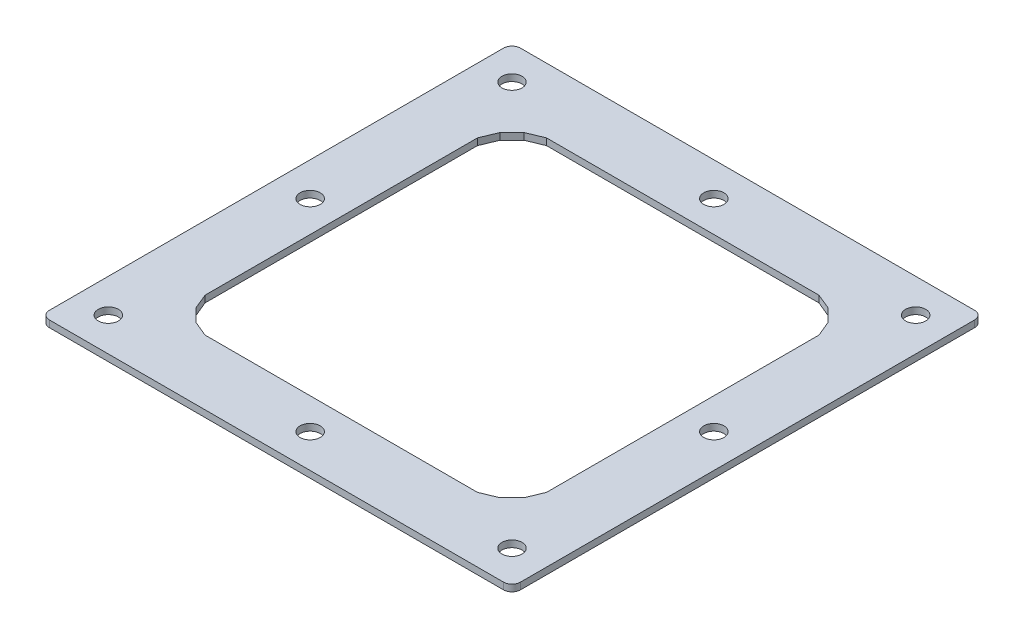
ISO-10303-21;
HEADER;
FILE_DESCRIPTION(('STEP AP214'),'2;1');
FILE_NAME('part.step','',(''),(''),'','','');
FILE_SCHEMA(('AUTOMOTIVE_DESIGN { 1 0 10303 214 1 1 1 1 }'));
ENDSEC;
DATA;
#1=APPLICATION_CONTEXT('core data for automotive mechanical design processes');
#2=APPLICATION_PROTOCOL_DEFINITION('international standard','automotive_design',2000,#1);
#3=PRODUCT_CONTEXT('',#1,'mechanical');
#4=PRODUCT('Part','Part','',(#3));
#5=PRODUCT_RELATED_PRODUCT_CATEGORY('part','',(#4));
#6=PRODUCT_DEFINITION_FORMATION('','',#4);
#7=PRODUCT_DEFINITION_CONTEXT('part definition',#1,'design');
#8=PRODUCT_DEFINITION('design','',#6,#7);
#9=PRODUCT_DEFINITION_SHAPE('','',#8);
#10=(LENGTH_UNIT() NAMED_UNIT(*) SI_UNIT(.MILLI.,.METRE.));
#11=(NAMED_UNIT(*) PLANE_ANGLE_UNIT() SI_UNIT($,.RADIAN.));
#12=(NAMED_UNIT(*) SI_UNIT($,.STERADIAN.) SOLID_ANGLE_UNIT());
#13=UNCERTAINTY_MEASURE_WITH_UNIT(LENGTH_MEASURE(1.E-05),#10,'distance_accuracy_value','');
#14=(GEOMETRIC_REPRESENTATION_CONTEXT(3) GLOBAL_UNCERTAINTY_ASSIGNED_CONTEXT((#13)) GLOBAL_UNIT_ASSIGNED_CONTEXT((#10,
#11,#12)) REPRESENTATION_CONTEXT('',''));
#15=CARTESIAN_POINT('',(0.,0.,0.));
#16=DIRECTION('',(0.,0.,1.));
#17=DIRECTION('',(1.,0.,0.));
#18=AXIS2_PLACEMENT_3D('',#15,#16,#17);
#19=CARTESIAN_POINT('',(140.,1552.70174894829,140.));
#20=DIRECTION('',(-1.,0.,0.));
#21=DIRECTION('',(0.,0.,1.));
#22=AXIS2_PLACEMENT_3D('',#19,#20,#21);
#23=PLANE('',#22);
#24=DIRECTION('',(0.,0.,1.));
#25=VECTOR('',#24,1.);
#26=CARTESIAN_POINT('',(140.,1548.70174894829,0.));
#27=LINE('',#26,#25);
#28=CARTESIAN_POINT('',(140.,1548.70174894829,-135.000000000001));
#29=VERTEX_POINT('',#28);
#30=CARTESIAN_POINT('',(140.,1548.70174894829,135.));
#31=VERTEX_POINT('',#30);
#32=EDGE_CURVE('E356',#29,#31,#27,.T.);
#33=ORIENTED_EDGE('',*,*,#32,.F.);
#34=DIRECTION('',(0.,-1.,0.));
#35=VECTOR('',#34,1.);
#36=CARTESIAN_POINT('',(140.,1552.70174894829,-135.000000000001));
#37=LINE('',#36,#35);
#38=CARTESIAN_POINT('',(140.,1552.70174894829,-135.000000000001));
#39=VERTEX_POINT('',#38);
#40=EDGE_CURVE('E414',#29,#39,#37,.F.);
#41=ORIENTED_EDGE('',*,*,#40,.T.);
#42=DIRECTION('',(0.,0.,1.));
#43=VECTOR('',#42,1.);
#44=CARTESIAN_POINT('',(140.,1552.70174894829,140.));
#45=LINE('',#44,#43);
#46=CARTESIAN_POINT('',(140.,1552.70174894829,135.));
#47=VERTEX_POINT('',#46);
#48=EDGE_CURVE('E274',#39,#47,#45,.T.);
#49=ORIENTED_EDGE('',*,*,#48,.T.);
#50=DIRECTION('',(0.,-1.,0.));
#51=VECTOR('',#50,1.);
#52=CARTESIAN_POINT('',(140.,1552.70174894829,135.));
#53=LINE('',#52,#51);
#54=EDGE_CURVE('E412',#47,#31,#53,.T.);
#55=ORIENTED_EDGE('',*,*,#54,.T.);
#56=EDGE_LOOP('',(#33,#41,#49,#55));
#57=FACE_BOUND('',#56,.T.);
#58=ADVANCED_FACE('F38',(#57),#23,.F.);
#59=CARTESIAN_POINT('',(140.,1552.70174894829,-140.000000000001));
#60=DIRECTION('',(0.,0.,1.));
#61=DIRECTION('',(1.,0.,0.));
#62=AXIS2_PLACEMENT_3D('',#59,#60,#61);
#63=PLANE('',#62);
#64=DIRECTION('',(1.,0.,0.));
#65=VECTOR('',#64,1.);
#66=CARTESIAN_POINT('',(0.,1548.70174894829,-140.000000000001));
#67=LINE('',#66,#65);
#68=CARTESIAN_POINT('',(-135.,1548.70174894829,-140.000000000001));
#69=VERTEX_POINT('',#68);
#70=CARTESIAN_POINT('',(135.,1548.70174894829,-140.000000000001));
#71=VERTEX_POINT('',#70);
#72=EDGE_CURVE('E352',#69,#71,#67,.T.);
#73=ORIENTED_EDGE('',*,*,#72,.F.);
#74=DIRECTION('',(0.,-1.,0.));
#75=VECTOR('',#74,1.);
#76=CARTESIAN_POINT('',(-135.,1552.70174894829,-140.000000000001));
#77=LINE('',#76,#75);
#78=CARTESIAN_POINT('',(-135.,1552.70174894829,-140.000000000001));
#79=VERTEX_POINT('',#78);
#80=EDGE_CURVE('E389',#69,#79,#77,.F.);
#81=ORIENTED_EDGE('',*,*,#80,.T.);
#82=DIRECTION('',(1.,0.,0.));
#83=VECTOR('',#82,1.);
#84=CARTESIAN_POINT('',(140.,1552.70174894829,-140.000000000001));
#85=LINE('',#84,#83);
#86=CARTESIAN_POINT('',(135.,1552.70174894829,-140.000000000001));
#87=VERTEX_POINT('',#86);
#88=EDGE_CURVE('E212',#79,#87,#85,.T.);
#89=ORIENTED_EDGE('',*,*,#88,.T.);
#90=DIRECTION('',(0.,-1.,0.));
#91=VECTOR('',#90,1.);
#92=CARTESIAN_POINT('',(135.,1552.70174894829,-140.000000000001));
#93=LINE('',#92,#91);
#94=EDGE_CURVE('E386',#87,#71,#93,.T.);
#95=ORIENTED_EDGE('',*,*,#94,.T.);
#96=EDGE_LOOP('',(#73,#81,#89,#95));
#97=FACE_BOUND('',#96,.T.);
#98=ADVANCED_FACE('F444',(#97),#63,.F.);
#99=CARTESIAN_POINT('',(-140.,1552.70174894829,139.999999999999));
#100=DIRECTION('',(1.,0.,0.));
#101=DIRECTION('',(0.,0.,-1.));
#102=AXIS2_PLACEMENT_3D('',#99,#100,#101);
#103=PLANE('',#102);
#104=DIRECTION('',(0.,0.,-1.));
#105=VECTOR('',#104,1.);
#106=CARTESIAN_POINT('',(-140.,1552.70174894829,139.999999999999));
#107=LINE('',#106,#105);
#108=CARTESIAN_POINT('',(-140.,1552.70174894829,134.999999999999));
#109=VERTEX_POINT('',#108);
#110=CARTESIAN_POINT('',(-140.,1552.70174894829,-135.000000000001));
#111=VERTEX_POINT('',#110);
#112=EDGE_CURVE('E269',#109,#111,#107,.T.);
#113=ORIENTED_EDGE('',*,*,#112,.T.);
#114=DIRECTION('',(0.,-1.,0.));
#115=VECTOR('',#114,1.);
#116=CARTESIAN_POINT('',(-140.,1552.70174894829,-135.000000000001));
#117=LINE('',#116,#115);
#118=CARTESIAN_POINT('',(-140.,1548.70174894829,-135.000000000001));
#119=VERTEX_POINT('',#118);
#120=EDGE_CURVE('E403',#111,#119,#117,.T.);
#121=ORIENTED_EDGE('',*,*,#120,.T.);
#122=DIRECTION('',(0.,0.,1.));
#123=VECTOR('',#122,1.);
#124=CARTESIAN_POINT('',(-140.,1548.70174894829,0.));
#125=LINE('',#124,#123);
#126=CARTESIAN_POINT('',(-140.,1548.70174894829,134.999999999999));
#127=VERTEX_POINT('',#126);
#128=EDGE_CURVE('E308',#127,#119,#125,.F.);
#129=ORIENTED_EDGE('',*,*,#128,.F.);
#130=DIRECTION('',(0.,-1.,0.));
#131=VECTOR('',#130,1.);
#132=CARTESIAN_POINT('',(-140.,1552.70174894829,134.999999999999));
#133=LINE('',#132,#131);
#134=EDGE_CURVE('E400',#127,#109,#133,.F.);
#135=ORIENTED_EDGE('',*,*,#134,.T.);
#136=EDGE_LOOP('',(#113,#121,#129,#135));
#137=FACE_BOUND('',#136,.T.);
#138=ADVANCED_FACE('F436',(#137),#103,.F.);
#139=CARTESIAN_POINT('',(-101.520883881533,1552.70174894829,-80.9836426045951));
#140=DIRECTION('',(0.923879532511287,0.,0.38268343236509));
#141=DIRECTION('',(0.38268343236509,0.,-0.923879532511287));
#142=AXIS2_PLACEMENT_3D('',#139,#140,#141);
#143=PLANE('',#142);
#144=DIRECTION('',(0.,1.,0.));
#145=VECTOR('',#144,1.);
#146=CARTESIAN_POINT('',(-101.520883881533,1552.70174894829,-80.9836426045951));
#147=LINE('',#146,#145);
#148=CARTESIAN_POINT('',(-101.520883881533,1548.70174894829,-80.9836426045951));
#149=VERTEX_POINT('',#148);
#150=CARTESIAN_POINT('',(-101.520883881533,1552.70174894829,-80.9836426045951));
#151=VERTEX_POINT('',#150);
#152=EDGE_CURVE('E227',#149,#151,#147,.T.);
#153=ORIENTED_EDGE('',*,*,#152,.F.);
#154=DIRECTION('',(0.38268343236509,0.,-0.923879532511287));
#155=VECTOR('',#154,1.);
#156=CARTESIAN_POINT('',(-101.520883881533,1548.70174894829,-80.9836426045951));
#157=LINE('',#156,#155);
#158=CARTESIAN_POINT('',(-97.6179290903931,1548.70174894829,-90.4062089946933));
#159=VERTEX_POINT('',#158);
#160=EDGE_CURVE('E345',#149,#159,#157,.T.);
#161=ORIENTED_EDGE('',*,*,#160,.T.);
#162=DIRECTION('',(0.,1.,0.));
#163=VECTOR('',#162,1.);
#164=CARTESIAN_POINT('',(-97.6179290903931,1552.70174894829,-90.4062089946933));
#165=LINE('',#164,#163);
#166=CARTESIAN_POINT('',(-97.6179290903931,1552.70174894829,-90.4062089946933));
#167=VERTEX_POINT('',#166);
#168=EDGE_CURVE('E384',#159,#167,#165,.T.);
#169=ORIENTED_EDGE('',*,*,#168,.T.);
#170=DIRECTION('',(0.38268343236509,0.,-0.923879532511287));
#171=VECTOR('',#170,1.);
#172=CARTESIAN_POINT('',(-101.520883881533,1552.70174894829,-80.9836426045951));
#173=LINE('',#172,#171);
#174=EDGE_CURVE('E228',#151,#167,#173,.T.);
#175=ORIENTED_EDGE('',*,*,#174,.F.);
#176=EDGE_LOOP('',(#153,#161,#169,#175));
#177=FACE_BOUND('',#176,.T.);
#178=ADVANCED_FACE('F479',(#177),#143,.T.);
#179=CARTESIAN_POINT('',(-97.6179290903931,1552.70174894829,-90.4062089946933));
#180=DIRECTION('',(0.707106781186549,0.,0.707106781186546));
#181=DIRECTION('',(0.707106781186546,0.,-0.707106781186549));
#182=AXIS2_PLACEMENT_3D('',#179,#180,#181);
#183=PLANE('',#182);
#184=ORIENTED_EDGE('',*,*,#168,.F.);
#185=DIRECTION('',(0.707106781186546,0.,-0.707106781186549));
#186=VECTOR('',#185,1.);
#187=CARTESIAN_POINT('',(-97.6179290903931,1548.70174894829,-90.4062089946933));
#188=LINE('',#187,#186);
#189=CARTESIAN_POINT('',(-90.4062089946916,1548.70174894829,-97.6179290903948));
#190=VERTEX_POINT('',#189);
#191=EDGE_CURVE('E342',#159,#190,#188,.T.);
#192=ORIENTED_EDGE('',*,*,#191,.T.);
#193=DIRECTION('',(0.,1.,0.));
#194=VECTOR('',#193,1.);
#195=CARTESIAN_POINT('',(-90.4062089946916,1552.70174894829,-97.6179290903948));
#196=LINE('',#195,#194);
#197=CARTESIAN_POINT('',(-90.4062089946916,1552.70174894829,-97.6179290903948));
#198=VERTEX_POINT('',#197);
#199=EDGE_CURVE('E382',#190,#198,#196,.T.);
#200=ORIENTED_EDGE('',*,*,#199,.T.);
#201=DIRECTION('',(0.707106781186546,0.,-0.707106781186549));
#202=VECTOR('',#201,1.);
#203=CARTESIAN_POINT('',(-97.6179290903931,1552.70174894829,-90.4062089946933));
#204=LINE('',#203,#202);
#205=EDGE_CURVE('E230',#167,#198,#204,.T.);
#206=ORIENTED_EDGE('',*,*,#205,.F.);
#207=EDGE_LOOP('',(#184,#192,#200,#206));
#208=FACE_BOUND('',#207,.T.);
#209=ADVANCED_FACE('F485',(#208),#183,.T.);
#210=CARTESIAN_POINT('',(-90.4062089946916,1552.70174894829,-97.6179290903948));
#211=DIRECTION('',(0.382683432365089,0.,0.923879532511287));
#212=DIRECTION('',(0.923879532511287,0.,-0.382683432365089));
#213=AXIS2_PLACEMENT_3D('',#210,#211,#212);
#214=PLANE('',#213);
#215=ORIENTED_EDGE('',*,*,#199,.F.);
#216=DIRECTION('',(0.923879532511287,0.,-0.382683432365089));
#217=VECTOR('',#216,1.);
#218=CARTESIAN_POINT('',(-90.4062089946916,1548.70174894829,-97.6179290903948));
#219=LINE('',#218,#217);
#220=CARTESIAN_POINT('',(-80.9836426045933,1548.70174894829,-101.520883881534));
#221=VERTEX_POINT('',#220);
#222=EDGE_CURVE('E339',#190,#221,#219,.T.);
#223=ORIENTED_EDGE('',*,*,#222,.T.);
#224=DIRECTION('',(0.,1.,0.));
#225=VECTOR('',#224,1.);
#226=CARTESIAN_POINT('',(-80.9836426045933,1552.70174894829,-101.520883881534));
#227=LINE('',#226,#225);
#228=CARTESIAN_POINT('',(-80.9836426045933,1552.70174894829,-101.520883881534));
#229=VERTEX_POINT('',#228);
#230=EDGE_CURVE('E380',#221,#229,#227,.T.);
#231=ORIENTED_EDGE('',*,*,#230,.T.);
#232=DIRECTION('',(0.923879532511287,0.,-0.382683432365089));
#233=VECTOR('',#232,1.);
#234=CARTESIAN_POINT('',(-90.4062089946916,1552.70174894829,-97.6179290903948));
#235=LINE('',#234,#233);
#236=EDGE_CURVE('E236',#198,#229,#235,.T.);
#237=ORIENTED_EDGE('',*,*,#236,.F.);
#238=EDGE_LOOP('',(#215,#223,#231,#237));
#239=FACE_BOUND('',#238,.T.);
#240=ADVANCED_FACE('F490',(#239),#214,.T.);
#241=CARTESIAN_POINT('',(-80.9836426045933,1552.70174894829,-101.520883881534));
#242=DIRECTION('',(0.,0.,1.));
#243=DIRECTION('',(1.,0.,0.));
#244=AXIS2_PLACEMENT_3D('',#241,#242,#243);
#245=PLANE('',#244);
#246=ORIENTED_EDGE('',*,*,#230,.F.);
#247=DIRECTION('',(1.,0.,0.));
#248=VECTOR('',#247,1.);
#249=CARTESIAN_POINT('',(0.,1548.70174894829,-101.520883881534));
#250=LINE('',#249,#248);
#251=CARTESIAN_POINT('',(80.9836426045933,1548.70174894829,-101.520883881534));
#252=VERTEX_POINT('',#251);
#253=EDGE_CURVE('E336',#221,#252,#250,.T.);
#254=ORIENTED_EDGE('',*,*,#253,.T.);
#255=DIRECTION('',(0.,1.,0.));
#256=VECTOR('',#255,1.);
#257=CARTESIAN_POINT('',(80.9836426045933,1552.70174894829,-101.520883881534));
#258=LINE('',#257,#256);
#259=CARTESIAN_POINT('',(80.9836426045933,1552.70174894829,-101.520883881534));
#260=VERTEX_POINT('',#259);
#261=EDGE_CURVE('E378',#252,#260,#258,.T.);
#262=ORIENTED_EDGE('',*,*,#261,.T.);
#263=DIRECTION('',(1.,0.,0.));
#264=VECTOR('',#263,1.);
#265=CARTESIAN_POINT('',(-80.9836426045933,1552.70174894829,-101.520883881534));
#266=LINE('',#265,#264);
#267=EDGE_CURVE('E239',#229,#260,#266,.T.);
#268=ORIENTED_EDGE('',*,*,#267,.F.);
#269=EDGE_LOOP('',(#246,#254,#262,#268));
#270=FACE_BOUND('',#269,.T.);
#271=ADVANCED_FACE('F502',(#270),#245,.T.);
#272=CARTESIAN_POINT('',(90.4062089946917,1552.70174894829,-97.6179290903948));
#273=DIRECTION('',(-0.382683432365089,0.,0.923879532511287));
#274=DIRECTION('',(0.923879532511287,0.,0.382683432365089));
#275=AXIS2_PLACEMENT_3D('',#272,#273,#274);
#276=PLANE('',#275);
#277=ORIENTED_EDGE('',*,*,#261,.F.);
#278=DIRECTION('',(0.923879532511287,0.,0.382683432365089));
#279=VECTOR('',#278,1.);
#280=CARTESIAN_POINT('',(90.4062089946917,1548.70174894829,-97.6179290903948));
#281=LINE('',#280,#279);
#282=CARTESIAN_POINT('',(90.4062089946917,1548.70174894829,-97.6179290903948));
#283=VERTEX_POINT('',#282);
#284=EDGE_CURVE('E333',#252,#283,#281,.T.);
#285=ORIENTED_EDGE('',*,*,#284,.T.);
#286=DIRECTION('',(0.,1.,0.));
#287=VECTOR('',#286,1.);
#288=CARTESIAN_POINT('',(90.4062089946917,1552.70174894829,-97.6179290903948));
#289=LINE('',#288,#287);
#290=CARTESIAN_POINT('',(90.4062089946917,1552.70174894829,-97.6179290903948));
#291=VERTEX_POINT('',#290);
#292=EDGE_CURVE('E376',#283,#291,#289,.T.);
#293=ORIENTED_EDGE('',*,*,#292,.T.);
#294=DIRECTION('',(0.923879532511287,0.,0.382683432365089));
#295=VECTOR('',#294,1.);
#296=CARTESIAN_POINT('',(90.4062089946917,1552.70174894829,-97.6179290903948));
#297=LINE('',#296,#295);
#298=EDGE_CURVE('E242',#260,#291,#297,.T.);
#299=ORIENTED_EDGE('',*,*,#298,.F.);
#300=EDGE_LOOP('',(#277,#285,#293,#299));
#301=FACE_BOUND('',#300,.T.);
#302=ADVANCED_FACE('F507',(#301),#276,.T.);
#303=CARTESIAN_POINT('',(97.6179290903931,1552.70174894829,-90.4062089946933));
#304=DIRECTION('',(-0.707106781186549,0.,0.707106781186546));
#305=DIRECTION('',(0.707106781186546,0.,0.707106781186549));
#306=AXIS2_PLACEMENT_3D('',#303,#304,#305);
#307=PLANE('',#306);
#308=ORIENTED_EDGE('',*,*,#292,.F.);
#309=DIRECTION('',(0.707106781186546,0.,0.707106781186549));
#310=VECTOR('',#309,1.);
#311=CARTESIAN_POINT('',(97.6179290903931,1548.70174894829,-90.4062089946933));
#312=LINE('',#311,#310);
#313=CARTESIAN_POINT('',(97.6179290903931,1548.70174894829,-90.4062089946933));
#314=VERTEX_POINT('',#313);
#315=EDGE_CURVE('E330',#283,#314,#312,.T.);
#316=ORIENTED_EDGE('',*,*,#315,.T.);
#317=DIRECTION('',(0.,1.,0.));
#318=VECTOR('',#317,1.);
#319=CARTESIAN_POINT('',(97.6179290903931,1552.70174894829,-90.4062089946933));
#320=LINE('',#319,#318);
#321=CARTESIAN_POINT('',(97.6179290903931,1552.70174894829,-90.4062089946933));
#322=VERTEX_POINT('',#321);
#323=EDGE_CURVE('E374',#314,#322,#320,.T.);
#324=ORIENTED_EDGE('',*,*,#323,.T.);
#325=DIRECTION('',(0.707106781186546,0.,0.707106781186549));
#326=VECTOR('',#325,1.);
#327=CARTESIAN_POINT('',(97.6179290903931,1552.70174894829,-90.4062089946933));
#328=LINE('',#327,#326);
#329=EDGE_CURVE('E245',#291,#322,#328,.T.);
#330=ORIENTED_EDGE('',*,*,#329,.F.);
#331=EDGE_LOOP('',(#308,#316,#324,#330));
#332=FACE_BOUND('',#331,.T.);
#333=ADVANCED_FACE('F512',(#332),#307,.T.);
#334=CARTESIAN_POINT('',(101.520883881533,1552.70174894829,-80.9836426045951));
#335=DIRECTION('',(-0.923879532511287,0.,0.38268343236509));
#336=DIRECTION('',(0.38268343236509,0.,0.923879532511287));
#337=AXIS2_PLACEMENT_3D('',#334,#335,#336);
#338=PLANE('',#337);
#339=ORIENTED_EDGE('',*,*,#323,.F.);
#340=DIRECTION('',(0.38268343236509,0.,0.923879532511287));
#341=VECTOR('',#340,1.);
#342=CARTESIAN_POINT('',(101.520883881533,1548.70174894829,-80.9836426045951));
#343=LINE('',#342,#341);
#344=CARTESIAN_POINT('',(101.520883881533,1548.70174894829,-80.9836426045951));
#345=VERTEX_POINT('',#344);
#346=EDGE_CURVE('E327',#314,#345,#343,.T.);
#347=ORIENTED_EDGE('',*,*,#346,.T.);
#348=DIRECTION('',(0.,1.,0.));
#349=VECTOR('',#348,1.);
#350=CARTESIAN_POINT('',(101.520883881533,1552.70174894829,-80.9836426045951));
#351=LINE('',#350,#349);
#352=CARTESIAN_POINT('',(101.520883881533,1552.70174894829,-80.9836426045951));
#353=VERTEX_POINT('',#352);
#354=EDGE_CURVE('E372',#345,#353,#351,.T.);
#355=ORIENTED_EDGE('',*,*,#354,.T.);
#356=DIRECTION('',(0.38268343236509,0.,0.923879532511287));
#357=VECTOR('',#356,1.);
#358=CARTESIAN_POINT('',(101.520883881533,1552.70174894829,-80.9836426045951));
#359=LINE('',#358,#357);
#360=EDGE_CURVE('E248',#322,#353,#359,.T.);
#361=ORIENTED_EDGE('',*,*,#360,.F.);
#362=EDGE_LOOP('',(#339,#347,#355,#361));
#363=FACE_BOUND('',#362,.T.);
#364=ADVANCED_FACE('F514',(#363),#338,.T.);
#365=CARTESIAN_POINT('',(101.520883881533,1552.70174894829,-80.9836426045951));
#366=DIRECTION('',(-1.,0.,0.));
#367=DIRECTION('',(0.,0.,1.));
#368=AXIS2_PLACEMENT_3D('',#365,#366,#367);
#369=PLANE('',#368);
#370=ORIENTED_EDGE('',*,*,#354,.F.);
#371=DIRECTION('',(0.,0.,1.));
#372=VECTOR('',#371,1.);
#373=CARTESIAN_POINT('',(101.520883881533,1548.70174894829,0.));
#374=LINE('',#373,#372);
#375=CARTESIAN_POINT('',(101.520883881533,1548.70174894829,80.9836426045935));
#376=VERTEX_POINT('',#375);
#377=EDGE_CURVE('E324',#345,#376,#374,.T.);
#378=ORIENTED_EDGE('',*,*,#377,.T.);
#379=DIRECTION('',(0.,1.,0.));
#380=VECTOR('',#379,1.);
#381=CARTESIAN_POINT('',(101.520883881533,1552.70174894829,80.9836426045935));
#382=LINE('',#381,#380);
#383=CARTESIAN_POINT('',(101.520883881533,1552.70174894829,80.9836426045935));
#384=VERTEX_POINT('',#383);
#385=EDGE_CURVE('E370',#376,#384,#382,.T.);
#386=ORIENTED_EDGE('',*,*,#385,.T.);
#387=DIRECTION('',(0.,0.,1.));
#388=VECTOR('',#387,1.);
#389=CARTESIAN_POINT('',(101.520883881533,1552.70174894829,-80.9836426045951));
#390=LINE('',#389,#388);
#391=EDGE_CURVE('E251',#353,#384,#390,.T.);
#392=ORIENTED_EDGE('',*,*,#391,.F.);
#393=EDGE_LOOP('',(#370,#378,#386,#392));
#394=FACE_BOUND('',#393,.T.);
#395=ADVANCED_FACE('F519',(#394),#369,.T.);
#396=CARTESIAN_POINT('',(101.520883881533,1552.70174894829,80.9836426045935));
#397=DIRECTION('',(-0.923879532511287,0.,-0.38268343236509));
#398=DIRECTION('',(-0.38268343236509,0.,0.923879532511287));
#399=AXIS2_PLACEMENT_3D('',#396,#397,#398);
#400=PLANE('',#399);
#401=ORIENTED_EDGE('',*,*,#385,.F.);
#402=DIRECTION('',(-0.38268343236509,0.,0.923879532511287));
#403=VECTOR('',#402,1.);
#404=CARTESIAN_POINT('',(101.520883881533,1548.70174894829,80.9836426045935));
#405=LINE('',#404,#403);
#406=CARTESIAN_POINT('',(97.6179290903933,1548.70174894829,90.4062089946918));
#407=VERTEX_POINT('',#406);
#408=EDGE_CURVE('E321',#376,#407,#405,.T.);
#409=ORIENTED_EDGE('',*,*,#408,.T.);
#410=DIRECTION('',(0.,1.,0.));
#411=VECTOR('',#410,1.);
#412=CARTESIAN_POINT('',(97.6179290903933,1552.70174894829,90.4062089946918));
#413=LINE('',#412,#411);
#414=CARTESIAN_POINT('',(97.6179290903933,1552.70174894829,90.4062089946918));
#415=VERTEX_POINT('',#414);
#416=EDGE_CURVE('E368',#407,#415,#413,.T.);
#417=ORIENTED_EDGE('',*,*,#416,.T.);
#418=DIRECTION('',(-0.38268343236509,0.,0.923879532511287));
#419=VECTOR('',#418,1.);
#420=CARTESIAN_POINT('',(101.520883881533,1552.70174894829,80.9836426045935));
#421=LINE('',#420,#419);
#422=EDGE_CURVE('E254',#384,#415,#421,.T.);
#423=ORIENTED_EDGE('',*,*,#422,.F.);
#424=EDGE_LOOP('',(#401,#409,#417,#423));
#425=FACE_BOUND('',#424,.T.);
#426=ADVANCED_FACE('F524',(#425),#400,.T.);
#427=CARTESIAN_POINT('',(97.6179290903933,1552.70174894829,90.4062089946918));
#428=DIRECTION('',(-0.707106781186549,0.,-0.707106781186546));
#429=DIRECTION('',(-0.707106781186546,0.,0.707106781186549));
#430=AXIS2_PLACEMENT_3D('',#427,#428,#429);
#431=PLANE('',#430);
#432=ORIENTED_EDGE('',*,*,#416,.F.);
#433=DIRECTION('',(-0.707106781186546,0.,0.707106781186549));
#434=VECTOR('',#433,1.);
#435=CARTESIAN_POINT('',(97.6179290903933,1548.70174894829,90.4062089946918));
#436=LINE('',#435,#434);
#437=CARTESIAN_POINT('',(90.4062089946918,1548.70174894829,97.6179290903933));
#438=VERTEX_POINT('',#437);
#439=EDGE_CURVE('E318',#407,#438,#436,.T.);
#440=ORIENTED_EDGE('',*,*,#439,.T.);
#441=DIRECTION('',(0.,1.,0.));
#442=VECTOR('',#441,1.);
#443=CARTESIAN_POINT('',(90.4062089946918,1552.70174894829,97.6179290903933));
#444=LINE('',#443,#442);
#445=CARTESIAN_POINT('',(90.4062089946918,1552.70174894829,97.6179290903933));
#446=VERTEX_POINT('',#445);
#447=EDGE_CURVE('E366',#438,#446,#444,.T.);
#448=ORIENTED_EDGE('',*,*,#447,.T.);
#449=DIRECTION('',(-0.707106781186546,0.,0.707106781186549));
#450=VECTOR('',#449,1.);
#451=CARTESIAN_POINT('',(97.6179290903933,1552.70174894829,90.4062089946918));
#452=LINE('',#451,#450);
#453=EDGE_CURVE('E257',#415,#446,#452,.T.);
#454=ORIENTED_EDGE('',*,*,#453,.F.);
#455=EDGE_LOOP('',(#432,#440,#448,#454));
#456=FACE_BOUND('',#455,.T.);
#457=ADVANCED_FACE('F526',(#456),#431,.T.);
#458=CARTESIAN_POINT('',(90.4062089946918,1552.70174894829,97.6179290903933));
#459=DIRECTION('',(-0.382683432365089,0.,-0.923879532511287));
#460=DIRECTION('',(-0.923879532511287,0.,0.382683432365089));
#461=AXIS2_PLACEMENT_3D('',#458,#459,#460);
#462=PLANE('',#461);
#463=ORIENTED_EDGE('',*,*,#447,.F.);
#464=DIRECTION('',(-0.923879532511287,0.,0.382683432365089));
#465=VECTOR('',#464,1.);
#466=CARTESIAN_POINT('',(90.4062089946918,1548.70174894829,97.6179290903933));
#467=LINE('',#466,#465);
#468=CARTESIAN_POINT('',(80.9836426045934,1548.70174894829,101.520883881533));
#469=VERTEX_POINT('',#468);
#470=EDGE_CURVE('E315',#438,#469,#467,.T.);
#471=ORIENTED_EDGE('',*,*,#470,.T.);
#472=DIRECTION('',(0.,1.,0.));
#473=VECTOR('',#472,1.);
#474=CARTESIAN_POINT('',(80.9836426045934,1552.70174894829,101.520883881533));
#475=LINE('',#474,#473);
#476=CARTESIAN_POINT('',(80.9836426045934,1552.70174894829,101.520883881533));
#477=VERTEX_POINT('',#476);
#478=EDGE_CURVE('E364',#469,#477,#475,.T.);
#479=ORIENTED_EDGE('',*,*,#478,.T.);
#480=DIRECTION('',(-0.923879532511287,0.,0.382683432365089));
#481=VECTOR('',#480,1.);
#482=CARTESIAN_POINT('',(90.4062089946918,1552.70174894829,97.6179290903933));
#483=LINE('',#482,#481);
#484=EDGE_CURVE('E260',#446,#477,#483,.T.);
#485=ORIENTED_EDGE('',*,*,#484,.F.);
#486=EDGE_LOOP('',(#463,#471,#479,#485));
#487=FACE_BOUND('',#486,.T.);
#488=ADVANCED_FACE('F531',(#487),#462,.T.);
#489=CARTESIAN_POINT('',(-80.9836426045933,1552.70174894829,101.520883881533));
#490=DIRECTION('',(0.,0.,-1.));
#491=DIRECTION('',(-1.,0.,0.));
#492=AXIS2_PLACEMENT_3D('',#489,#490,#491);
#493=PLANE('',#492);
#494=ORIENTED_EDGE('',*,*,#478,.F.);
#495=DIRECTION('',(1.,0.,0.));
#496=VECTOR('',#495,1.);
#497=CARTESIAN_POINT('',(0.,1548.70174894829,101.520883881533));
#498=LINE('',#497,#496);
#499=CARTESIAN_POINT('',(-80.9836426045933,1548.70174894829,101.520883881533));
#500=VERTEX_POINT('',#499);
#501=EDGE_CURVE('E312',#469,#500,#498,.F.);
#502=ORIENTED_EDGE('',*,*,#501,.T.);
#503=DIRECTION('',(0.,1.,0.));
#504=VECTOR('',#503,1.);
#505=CARTESIAN_POINT('',(-80.9836426045933,1552.70174894829,101.520883881533));
#506=LINE('',#505,#504);
#507=CARTESIAN_POINT('',(-80.9836426045933,1552.70174894829,101.520883881533));
#508=VERTEX_POINT('',#507);
#509=EDGE_CURVE('E362',#500,#508,#506,.T.);
#510=ORIENTED_EDGE('',*,*,#509,.T.);
#511=DIRECTION('',(-1.,0.,0.));
#512=VECTOR('',#511,1.);
#513=CARTESIAN_POINT('',(-80.9836426045933,1552.70174894829,101.520883881533));
#514=LINE('',#513,#512);
#515=EDGE_CURVE('E263',#477,#508,#514,.T.);
#516=ORIENTED_EDGE('',*,*,#515,.F.);
#517=EDGE_LOOP('',(#494,#502,#510,#516));
#518=FACE_BOUND('',#517,.T.);
#519=ADVANCED_FACE('F536',(#518),#493,.T.);
#520=CARTESIAN_POINT('',(-90.4062089946916,1552.70174894829,97.6179290903933));
#521=DIRECTION('',(0.382683432365089,0.,-0.923879532511287));
#522=DIRECTION('',(-0.923879532511287,0.,-0.382683432365089));
#523=AXIS2_PLACEMENT_3D('',#520,#521,#522);
#524=PLANE('',#523);
#525=ORIENTED_EDGE('',*,*,#509,.F.);
#526=DIRECTION('',(-0.923879532511287,0.,-0.382683432365089));
#527=VECTOR('',#526,1.);
#528=CARTESIAN_POINT('',(-90.4062089946916,1548.70174894829,97.6179290903933));
#529=LINE('',#528,#527);
#530=CARTESIAN_POINT('',(-90.4062089946916,1548.70174894829,97.6179290903933));
#531=VERTEX_POINT('',#530);
#532=EDGE_CURVE('E309',#500,#531,#529,.T.);
#533=ORIENTED_EDGE('',*,*,#532,.T.);
#534=DIRECTION('',(0.,1.,0.));
#535=VECTOR('',#534,1.);
#536=CARTESIAN_POINT('',(-90.4062089946916,1552.70174894829,97.6179290903933));
#537=LINE('',#536,#535);
#538=CARTESIAN_POINT('',(-90.4062089946916,1552.70174894829,97.6179290903933));
#539=VERTEX_POINT('',#538);
#540=EDGE_CURVE('E360',#531,#539,#537,.T.);
#541=ORIENTED_EDGE('',*,*,#540,.T.);
#542=DIRECTION('',(-0.923879532511287,0.,-0.382683432365089));
#543=VECTOR('',#542,1.);
#544=CARTESIAN_POINT('',(-90.4062089946916,1552.70174894829,97.6179290903933));
#545=LINE('',#544,#543);
#546=EDGE_CURVE('E266',#508,#539,#545,.T.);
#547=ORIENTED_EDGE('',*,*,#546,.F.);
#548=EDGE_LOOP('',(#525,#533,#541,#547));
#549=FACE_BOUND('',#548,.T.);
#550=ADVANCED_FACE('F538',(#549),#524,.T.);
#551=CARTESIAN_POINT('',(-97.6179290903931,1552.70174894829,90.4062089946918));
#552=DIRECTION('',(0.707106781186549,0.,-0.707106781186546));
#553=DIRECTION('',(-0.707106781186546,0.,-0.707106781186549));
#554=AXIS2_PLACEMENT_3D('',#551,#552,#553);
#555=PLANE('',#554);
#556=ORIENTED_EDGE('',*,*,#540,.F.);
#557=DIRECTION('',(-0.707106781186546,0.,-0.707106781186549));
#558=VECTOR('',#557,1.);
#559=CARTESIAN_POINT('',(-97.6179290903931,1548.70174894829,90.4062089946918));
#560=LINE('',#559,#558);
#561=CARTESIAN_POINT('',(-97.6179290903931,1548.70174894829,90.4062089946918));
#562=VERTEX_POINT('',#561);
#563=EDGE_CURVE('E305',#531,#562,#560,.T.);
#564=ORIENTED_EDGE('',*,*,#563,.T.);
#565=DIRECTION('',(0.,1.,0.));
#566=VECTOR('',#565,1.);
#567=CARTESIAN_POINT('',(-97.6179290903931,1552.70174894829,90.4062089946918));
#568=LINE('',#567,#566);
#569=CARTESIAN_POINT('',(-97.6179290903931,1552.70174894829,90.4062089946918));
#570=VERTEX_POINT('',#569);
#571=EDGE_CURVE('E211',#562,#570,#568,.T.);
#572=ORIENTED_EDGE('',*,*,#571,.T.);
#573=DIRECTION('',(-0.707106781186546,0.,-0.707106781186549));
#574=VECTOR('',#573,1.);
#575=CARTESIAN_POINT('',(-97.6179290903931,1552.70174894829,90.4062089946918));
#576=LINE('',#575,#574);
#577=EDGE_CURVE('E223',#539,#570,#576,.T.);
#578=ORIENTED_EDGE('',*,*,#577,.F.);
#579=EDGE_LOOP('',(#556,#564,#572,#578));
#580=FACE_BOUND('',#579,.T.);
#581=ADVANCED_FACE('F541',(#580),#555,.T.);
#582=CARTESIAN_POINT('',(-101.520883881533,1552.70174894829,80.9836426045935));
#583=DIRECTION('',(0.923879532511287,0.,-0.38268343236509));
#584=DIRECTION('',(-0.38268343236509,0.,-0.923879532511287));
#585=AXIS2_PLACEMENT_3D('',#582,#583,#584);
#586=PLANE('',#585);
#587=ORIENTED_EDGE('',*,*,#571,.F.);
#588=DIRECTION('',(-0.38268343236509,0.,-0.923879532511287));
#589=VECTOR('',#588,1.);
#590=CARTESIAN_POINT('',(-101.520883881533,1548.70174894829,80.9836426045935));
#591=LINE('',#590,#589);
#592=CARTESIAN_POINT('',(-101.520883881533,1548.70174894829,80.9836426045935));
#593=VERTEX_POINT('',#592);
#594=EDGE_CURVE('E206',#562,#593,#591,.T.);
#595=ORIENTED_EDGE('',*,*,#594,.T.);
#596=DIRECTION('',(0.,1.,0.));
#597=VECTOR('',#596,1.);
#598=CARTESIAN_POINT('',(-101.520883881533,1552.70174894829,80.9836426045935));
#599=LINE('',#598,#597);
#600=CARTESIAN_POINT('',(-101.520883881533,1552.70174894829,80.9836426045935));
#601=VERTEX_POINT('',#600);
#602=EDGE_CURVE('E200',#593,#601,#599,.T.);
#603=ORIENTED_EDGE('',*,*,#602,.T.);
#604=DIRECTION('',(-0.38268343236509,0.,-0.923879532511287));
#605=VECTOR('',#604,1.);
#606=CARTESIAN_POINT('',(-101.520883881533,1552.70174894829,80.9836426045935));
#607=LINE('',#606,#605);
#608=EDGE_CURVE('E203',#570,#601,#607,.T.);
#609=ORIENTED_EDGE('',*,*,#608,.F.);
#610=EDGE_LOOP('',(#587,#595,#603,#609));
#611=FACE_BOUND('',#610,.T.);
#612=ADVANCED_FACE('F202',(#611),#586,.T.);
#613=CARTESIAN_POINT('',(-120.,1552.70174894829,-120.000000000001));
#614=DIRECTION('',(0.,-1.,0.));
#615=DIRECTION('',(0.,0.,-1.));
#616=AXIS2_PLACEMENT_3D('',#613,#614,#615);
#617=CYLINDRICAL_SURFACE('',#616,6.);
#618=CARTESIAN_POINT('',(-120.,1552.70174894829,-120.000000000001));
#619=DIRECTION('',(0.,-1.,0.));
#620=DIRECTION('',(0.,0.,1.));
#621=AXIS2_PLACEMENT_3D('',#618,#619,#620);
#622=CIRCLE('',#621,6.);
#623=CARTESIAN_POINT('',(-120.,1552.70174894829,-114.000000000001));
#624=VERTEX_POINT('',#623);
#625=EDGE_CURVE('E355',#624,#624,#622,.T.);
#626=ORIENTED_EDGE('',*,*,#625,.F.);
#627=EDGE_LOOP('',(#626));
#628=FACE_BOUND('',#627,.T.);
#629=CARTESIAN_POINT('',(-120.,1548.70174894829,-120.000000000001));
#630=DIRECTION('',(0.,-1.,0.));
#631=DIRECTION('',(0.,0.,-1.));
#632=AXIS2_PLACEMENT_3D('',#629,#630,#631);
#633=CIRCLE('',#632,6.);
#634=CARTESIAN_POINT('',(-120.,1548.70174894829,-126.000000000001));
#635=VERTEX_POINT('',#634);
#636=EDGE_CURVE('E279',#635,#635,#633,.T.);
#637=ORIENTED_EDGE('',*,*,#636,.T.);
#638=EDGE_LOOP('',(#637));
#639=FACE_BOUND('',#638,.T.);
#640=ADVANCED_FACE('F548',(#628,#639),#617,.F.);
#641=CARTESIAN_POINT('',(-1.11026162508994E-13,1552.70174894829,-120.000000000001));
#642=DIRECTION('',(0.,-1.,0.));
#643=DIRECTION('',(0.,0.,-1.));
#644=AXIS2_PLACEMENT_3D('',#641,#642,#643);
#645=CYLINDRICAL_SURFACE('',#644,6.);
#646=CARTESIAN_POINT('',(-1.11026162508994E-13,1552.70174894829,-120.000000000001));
#647=DIRECTION('',(0.,-1.,0.));
#648=DIRECTION('',(0.,0.,1.));
#649=AXIS2_PLACEMENT_3D('',#646,#647,#648);
#650=CIRCLE('',#649,6.);
#651=CARTESIAN_POINT('',(-1.11026162508994E-13,1552.70174894829,-114.000000000001));
#652=VERTEX_POINT('',#651);
#653=EDGE_CURVE('E984',#652,#652,#650,.T.);
#654=ORIENTED_EDGE('',*,*,#653,.F.);
#655=EDGE_LOOP('',(#654));
#656=FACE_BOUND('',#655,.T.);
#657=CARTESIAN_POINT('',(-1.11026162508994E-13,1548.70174894829,-120.000000000001));
#658=DIRECTION('',(0.,-1.,0.));
#659=DIRECTION('',(0.,0.,-1.));
#660=AXIS2_PLACEMENT_3D('',#657,#658,#659);
#661=CIRCLE('',#660,6.);
#662=CARTESIAN_POINT('',(-1.11026162508994E-13,1548.70174894829,-126.000000000001));
#663=VERTEX_POINT('',#662);
#664=EDGE_CURVE('E282',#663,#663,#661,.T.);
#665=ORIENTED_EDGE('',*,*,#664,.T.);
#666=EDGE_LOOP('',(#665));
#667=FACE_BOUND('',#666,.T.);
#668=ADVANCED_FACE('F637',(#656,#667),#645,.F.);
#669=CARTESIAN_POINT('',(120.,1552.70174894829,-120.000000000001));
#670=DIRECTION('',(0.,-1.,0.));
#671=DIRECTION('',(0.,0.,-1.));
#672=AXIS2_PLACEMENT_3D('',#669,#670,#671);
#673=CYLINDRICAL_SURFACE('',#672,6.);
#674=CARTESIAN_POINT('',(120.,1552.70174894829,-120.000000000001));
#675=DIRECTION('',(0.,-1.,0.));
#676=DIRECTION('',(0.,0.,-1.));
#677=AXIS2_PLACEMENT_3D('',#674,#675,#676);
#678=CIRCLE('',#677,6.);
#679=CARTESIAN_POINT('',(120.,1552.70174894829,-126.000000000001));
#680=VERTEX_POINT('',#679);
#681=EDGE_CURVE('E981',#680,#680,#678,.T.);
#682=ORIENTED_EDGE('',*,*,#681,.F.);
#683=EDGE_LOOP('',(#682));
#684=FACE_BOUND('',#683,.T.);
#685=CARTESIAN_POINT('',(120.,1548.70174894829,-120.000000000001));
#686=DIRECTION('',(0.,-1.,0.));
#687=DIRECTION('',(0.,0.,-1.));
#688=AXIS2_PLACEMENT_3D('',#685,#686,#687);
#689=CIRCLE('',#688,6.);
#690=CARTESIAN_POINT('',(120.,1548.70174894829,-126.000000000001));
#691=VERTEX_POINT('',#690);
#692=EDGE_CURVE('E285',#691,#691,#689,.T.);
#693=ORIENTED_EDGE('',*,*,#692,.T.);
#694=EDGE_LOOP('',(#693));
#695=FACE_BOUND('',#694,.T.);
#696=ADVANCED_FACE('F648',(#684,#695),#673,.F.);
#697=CARTESIAN_POINT('',(120.,1552.70174894829,120.));
#698=DIRECTION('',(0.,-1.,0.));
#699=DIRECTION('',(0.,0.,-1.));
#700=AXIS2_PLACEMENT_3D('',#697,#698,#699);
#701=CYLINDRICAL_SURFACE('',#700,6.);
#702=CARTESIAN_POINT('',(120.,1552.70174894829,120.));
#703=DIRECTION('',(0.,-1.,0.));
#704=DIRECTION('',(0.,0.,1.));
#705=AXIS2_PLACEMENT_3D('',#702,#703,#704);
#706=CIRCLE('',#705,6.);
#707=CARTESIAN_POINT('',(120.,1552.70174894829,126.));
#708=VERTEX_POINT('',#707);
#709=EDGE_CURVE('E978',#708,#708,#706,.T.);
#710=ORIENTED_EDGE('',*,*,#709,.F.);
#711=EDGE_LOOP('',(#710));
#712=FACE_BOUND('',#711,.T.);
#713=CARTESIAN_POINT('',(120.,1548.70174894829,120.));
#714=DIRECTION('',(0.,-1.,0.));
#715=DIRECTION('',(0.,0.,-1.));
#716=AXIS2_PLACEMENT_3D('',#713,#714,#715);
#717=CIRCLE('',#716,6.);
#718=CARTESIAN_POINT('',(120.,1548.70174894829,114.));
#719=VERTEX_POINT('',#718);
#720=EDGE_CURVE('E288',#719,#719,#717,.T.);
#721=ORIENTED_EDGE('',*,*,#720,.T.);
#722=EDGE_LOOP('',(#721));
#723=FACE_BOUND('',#722,.T.);
#724=ADVANCED_FACE('F659',(#712,#723),#701,.F.);
#725=CARTESIAN_POINT('',(120.000000000001,1552.70174894829,-2.28458362921805E-13));
#726=DIRECTION('',(0.,-1.,0.));
#727=DIRECTION('',(0.,0.,-1.));
#728=AXIS2_PLACEMENT_3D('',#725,#726,#727);
#729=CYLINDRICAL_SURFACE('',#728,5.99999999999999);
#730=CARTESIAN_POINT('',(120.000000000001,1552.70174894829,-2.28458362921805E-13));
#731=DIRECTION('',(0.,-1.,0.));
#732=DIRECTION('',(0.,0.,1.));
#733=AXIS2_PLACEMENT_3D('',#730,#731,#732);
#734=CIRCLE('',#733,5.99999999999999);
#735=CARTESIAN_POINT('',(120.000000000001,1552.70174894829,5.99999999999977));
#736=VERTEX_POINT('',#735);
#737=EDGE_CURVE('E973',#736,#736,#734,.T.);
#738=ORIENTED_EDGE('',*,*,#737,.F.);
#739=EDGE_LOOP('',(#738));
#740=FACE_BOUND('',#739,.T.);
#741=CARTESIAN_POINT('',(120.000000000001,1548.70174894829,-2.28458362921805E-13));
#742=DIRECTION('',(0.,-1.,0.));
#743=DIRECTION('',(0.,0.,-1.));
#744=AXIS2_PLACEMENT_3D('',#741,#742,#743);
#745=CIRCLE('',#744,5.99999999999999);
#746=CARTESIAN_POINT('',(120.000000000001,1548.70174894829,-6.00000000000022));
#747=VERTEX_POINT('',#746);
#748=EDGE_CURVE('E291',#747,#747,#745,.T.);
#749=ORIENTED_EDGE('',*,*,#748,.T.);
#750=EDGE_LOOP('',(#749));
#751=FACE_BOUND('',#750,.T.);
#752=ADVANCED_FACE('F670',(#740,#751),#729,.F.);
#753=CARTESIAN_POINT('',(-120.,1552.70174894829,-7.83562155141428E-13));
#754=DIRECTION('',(0.,-1.,0.));
#755=DIRECTION('',(0.,0.,-1.));
#756=AXIS2_PLACEMENT_3D('',#753,#754,#755);
#757=CYLINDRICAL_SURFACE('',#756,6.);
#758=CARTESIAN_POINT('',(-120.,1552.70174894829,-7.83562155141428E-13));
#759=DIRECTION('',(0.,-1.,0.));
#760=DIRECTION('',(0.,0.,-1.));
#761=AXIS2_PLACEMENT_3D('',#758,#759,#760);
#762=CIRCLE('',#761,6.);
#763=CARTESIAN_POINT('',(-120.,1552.70174894829,-6.00000000000079));
#764=VERTEX_POINT('',#763);
#765=EDGE_CURVE('E969',#764,#764,#762,.T.);
#766=ORIENTED_EDGE('',*,*,#765,.F.);
#767=EDGE_LOOP('',(#766));
#768=FACE_BOUND('',#767,.T.);
#769=CARTESIAN_POINT('',(-120.,1548.70174894829,-7.83562155141428E-13));
#770=DIRECTION('',(0.,-1.,0.));
#771=DIRECTION('',(0.,0.,-1.));
#772=AXIS2_PLACEMENT_3D('',#769,#770,#771);
#773=CIRCLE('',#772,6.);
#774=CARTESIAN_POINT('',(-120.,1548.70174894829,-6.00000000000079));
#775=VERTEX_POINT('',#774);
#776=EDGE_CURVE('E294',#775,#775,#773,.T.);
#777=ORIENTED_EDGE('',*,*,#776,.T.);
#778=EDGE_LOOP('',(#777));
#779=FACE_BOUND('',#778,.T.);
#780=ADVANCED_FACE('F681',(#768,#779),#757,.F.);
#781=CARTESIAN_POINT('',(0.,1552.70174894829,119.999999999999));
#782=DIRECTION('',(0.,-1.,0.));
#783=DIRECTION('',(0.,0.,-1.));
#784=AXIS2_PLACEMENT_3D('',#781,#782,#783);
#785=CYLINDRICAL_SURFACE('',#784,6.);
#786=CARTESIAN_POINT('',(0.,1552.70174894829,119.999999999999));
#787=DIRECTION('',(0.,-1.,0.));
#788=DIRECTION('',(0.,0.,-1.));
#789=AXIS2_PLACEMENT_3D('',#786,#787,#788);
#790=CIRCLE('',#789,6.);
#791=CARTESIAN_POINT('',(0.,1552.70174894829,113.999999999999));
#792=VERTEX_POINT('',#791);
#793=EDGE_CURVE('E967',#792,#792,#790,.T.);
#794=ORIENTED_EDGE('',*,*,#793,.F.);
#795=EDGE_LOOP('',(#794));
#796=FACE_BOUND('',#795,.T.);
#797=CARTESIAN_POINT('',(0.,1548.70174894829,119.999999999999));
#798=DIRECTION('',(0.,-1.,0.));
#799=DIRECTION('',(0.,0.,-1.));
#800=AXIS2_PLACEMENT_3D('',#797,#798,#799);
#801=CIRCLE('',#800,6.);
#802=CARTESIAN_POINT('',(0.,1548.70174894829,113.999999999999));
#803=VERTEX_POINT('',#802);
#804=EDGE_CURVE('E297',#803,#803,#801,.T.);
#805=ORIENTED_EDGE('',*,*,#804,.T.);
#806=EDGE_LOOP('',(#805));
#807=FACE_BOUND('',#806,.T.);
#808=ADVANCED_FACE('F475',(#796,#807),#785,.F.);
#809=CARTESIAN_POINT('',(-120.,1552.70174894829,119.999999999999));
#810=DIRECTION('',(0.,-1.,0.));
#811=DIRECTION('',(0.,0.,-1.));
#812=AXIS2_PLACEMENT_3D('',#809,#810,#811);
#813=CYLINDRICAL_SURFACE('',#812,6.);
#814=CARTESIAN_POINT('',(-120.,1552.70174894829,119.999999999999));
#815=DIRECTION('',(0.,-1.,0.));
#816=DIRECTION('',(0.,0.,-1.));
#817=AXIS2_PLACEMENT_3D('',#814,#815,#816);
#818=CIRCLE('',#817,6.);
#819=CARTESIAN_POINT('',(-120.,1552.70174894829,113.999999999999));
#820=VERTEX_POINT('',#819);
#821=EDGE_CURVE('E224',#820,#820,#818,.T.);
#822=ORIENTED_EDGE('',*,*,#821,.F.);
#823=EDGE_LOOP('',(#822));
#824=FACE_BOUND('',#823,.T.);
#825=CARTESIAN_POINT('',(-120.,1548.70174894829,119.999999999999));
#826=DIRECTION('',(0.,-1.,0.));
#827=DIRECTION('',(0.,0.,-1.));
#828=AXIS2_PLACEMENT_3D('',#825,#826,#827);
#829=CIRCLE('',#828,6.);
#830=CARTESIAN_POINT('',(-120.,1548.70174894829,113.999999999999));
#831=VERTEX_POINT('',#830);
#832=EDGE_CURVE('E300',#831,#831,#829,.T.);
#833=ORIENTED_EDGE('',*,*,#832,.T.);
#834=EDGE_LOOP('',(#833));
#835=FACE_BOUND('',#834,.T.);
#836=ADVANCED_FACE('F470',(#824,#835),#813,.F.);
#837=CARTESIAN_POINT('',(-101.520883881533,1552.70174894829,-80.9836426045951));
#838=DIRECTION('',(1.,0.,0.));
#839=DIRECTION('',(0.,0.,-1.));
#840=AXIS2_PLACEMENT_3D('',#837,#838,#839);
#841=PLANE('',#840);
#842=DIRECTION('',(0.,0.,1.));
#843=VECTOR('',#842,1.);
#844=CARTESIAN_POINT('',(-101.520883881533,1548.70174894829,0.));
#845=LINE('',#844,#843);
#846=EDGE_CURVE('E304',#593,#149,#845,.F.);
#847=ORIENTED_EDGE('',*,*,#846,.T.);
#848=ORIENTED_EDGE('',*,*,#152,.T.);
#849=DIRECTION('',(0.,0.,-1.));
#850=VECTOR('',#849,1.);
#851=CARTESIAN_POINT('',(-101.520883881533,1552.70174894829,-80.9836426045951));
#852=LINE('',#851,#850);
#853=EDGE_CURVE('E219',#601,#151,#852,.T.);
#854=ORIENTED_EDGE('',*,*,#853,.F.);
#855=ORIENTED_EDGE('',*,*,#602,.F.);
#856=EDGE_LOOP('',(#847,#848,#854,#855));
#857=FACE_BOUND('',#856,.T.);
#858=ADVANCED_FACE('F226',(#857),#841,.T.);
#859=CARTESIAN_POINT('',(140.,1552.70174894829,140.));
#860=DIRECTION('',(0.,0.,-1.));
#861=DIRECTION('',(-1.,0.,0.));
#862=AXIS2_PLACEMENT_3D('',#859,#860,#861);
#863=PLANE('',#862);
#864=DIRECTION('',(1.,0.,0.));
#865=VECTOR('',#864,1.);
#866=CARTESIAN_POINT('',(0.,1548.70174894829,140.));
#867=LINE('',#866,#865);
#868=CARTESIAN_POINT('',(135.,1548.70174894829,140.));
#869=VERTEX_POINT('',#868);
#870=CARTESIAN_POINT('',(-135.,1548.70174894829,140.));
#871=VERTEX_POINT('',#870);
#872=EDGE_CURVE('E351',#869,#871,#867,.F.);
#873=ORIENTED_EDGE('',*,*,#872,.F.);
#874=DIRECTION('',(0.,-1.,0.));
#875=VECTOR('',#874,1.);
#876=CARTESIAN_POINT('',(135.,1552.70174894829,140.));
#877=LINE('',#876,#875);
#878=CARTESIAN_POINT('',(135.,1552.70174894829,140.));
#879=VERTEX_POINT('',#878);
#880=EDGE_CURVE('E11',#869,#879,#877,.F.);
#881=ORIENTED_EDGE('',*,*,#880,.T.);
#882=DIRECTION('',(-1.,0.,0.));
#883=VECTOR('',#882,1.);
#884=CARTESIAN_POINT('',(140.,1552.70174894829,140.));
#885=LINE('',#884,#883);
#886=CARTESIAN_POINT('',(-135.,1552.70174894829,139.999999999999));
#887=VERTEX_POINT('',#886);
#888=EDGE_CURVE('E272',#879,#887,#885,.T.);
#889=ORIENTED_EDGE('',*,*,#888,.T.);
#890=DIRECTION('',(0.,-1.,0.));
#891=VECTOR('',#890,1.);
#892=CARTESIAN_POINT('',(-135.,1552.70174894829,139.999999999999));
#893=LINE('',#892,#891);
#894=EDGE_CURVE('E46',#887,#871,#893,.T.);
#895=ORIENTED_EDGE('',*,*,#894,.T.);
#896=EDGE_LOOP('',(#873,#881,#889,#895));
#897=FACE_BOUND('',#896,.T.);
#898=ADVANCED_FACE('F428',(#897),#863,.F.);
#899=CARTESIAN_POINT('',(0.,1552.70174894829,0.));
#900=DIRECTION('',(0.,1.,0.));
#901=DIRECTION('',(0.,0.,1.));
#902=AXIS2_PLACEMENT_3D('',#899,#900,#901);
#903=PLANE('',#902);
#904=ORIENTED_EDGE('',*,*,#625,.T.);
#905=EDGE_LOOP('',(#904));
#906=FACE_BOUND('',#905,.T.);
#907=ORIENTED_EDGE('',*,*,#653,.T.);
#908=EDGE_LOOP('',(#907));
#909=FACE_BOUND('',#908,.T.);
#910=ORIENTED_EDGE('',*,*,#681,.T.);
#911=EDGE_LOOP('',(#910));
#912=FACE_BOUND('',#911,.T.);
#913=ORIENTED_EDGE('',*,*,#709,.T.);
#914=EDGE_LOOP('',(#913));
#915=FACE_BOUND('',#914,.T.);
#916=ORIENTED_EDGE('',*,*,#737,.T.);
#917=EDGE_LOOP('',(#916));
#918=FACE_BOUND('',#917,.T.);
#919=ORIENTED_EDGE('',*,*,#765,.T.);
#920=EDGE_LOOP('',(#919));
#921=FACE_BOUND('',#920,.T.);
#922=ORIENTED_EDGE('',*,*,#793,.T.);
#923=EDGE_LOOP('',(#922));
#924=FACE_BOUND('',#923,.T.);
#925=ORIENTED_EDGE('',*,*,#821,.T.);
#926=EDGE_LOOP('',(#925));
#927=FACE_BOUND('',#926,.T.);
#928=ORIENTED_EDGE('',*,*,#608,.T.);
#929=ORIENTED_EDGE('',*,*,#853,.T.);
#930=ORIENTED_EDGE('',*,*,#174,.T.);
#931=ORIENTED_EDGE('',*,*,#205,.T.);
#932=ORIENTED_EDGE('',*,*,#236,.T.);
#933=ORIENTED_EDGE('',*,*,#267,.T.);
#934=ORIENTED_EDGE('',*,*,#298,.T.);
#935=ORIENTED_EDGE('',*,*,#329,.T.);
#936=ORIENTED_EDGE('',*,*,#360,.T.);
#937=ORIENTED_EDGE('',*,*,#391,.T.);
#938=ORIENTED_EDGE('',*,*,#422,.T.);
#939=ORIENTED_EDGE('',*,*,#453,.T.);
#940=ORIENTED_EDGE('',*,*,#484,.T.);
#941=ORIENTED_EDGE('',*,*,#515,.T.);
#942=ORIENTED_EDGE('',*,*,#546,.T.);
#943=ORIENTED_EDGE('',*,*,#577,.T.);
#944=EDGE_LOOP('',(#928,#929,#930,#931,#932,#933,#934,#935,#936,#937,#938,#939,#940,#941,#942,#943));
#945=FACE_BOUND('',#944,.T.);
#946=ORIENTED_EDGE('',*,*,#88,.F.);
#947=CARTESIAN_POINT('',(-135.,1552.70174894829,-135.000000000001));
#948=DIRECTION('',(0.,1.,0.));
#949=DIRECTION('',(0.,0.,1.));
#950=AXIS2_PLACEMENT_3D('',#947,#948,#949);
#951=CIRCLE('',#950,5.);
#952=EDGE_CURVE('E398',#79,#111,#951,.T.);
#953=ORIENTED_EDGE('',*,*,#952,.T.);
#954=ORIENTED_EDGE('',*,*,#112,.F.);
#955=CARTESIAN_POINT('',(-135.,1552.70174894829,134.999999999999));
#956=DIRECTION('',(0.,1.,0.));
#957=DIRECTION('',(0.,0.,1.));
#958=AXIS2_PLACEMENT_3D('',#955,#956,#957);
#959=CIRCLE('',#958,5.);
#960=EDGE_CURVE('E392',#109,#887,#959,.T.);
#961=ORIENTED_EDGE('',*,*,#960,.T.);
#962=ORIENTED_EDGE('',*,*,#888,.F.);
#963=CARTESIAN_POINT('',(135.,1552.70174894829,135.));
#964=DIRECTION('',(0.,1.,0.));
#965=DIRECTION('',(0.,0.,1.));
#966=AXIS2_PLACEMENT_3D('',#963,#964,#965);
#967=CIRCLE('',#966,5.);
#968=EDGE_CURVE('E394',#879,#47,#967,.T.);
#969=ORIENTED_EDGE('',*,*,#968,.T.);
#970=ORIENTED_EDGE('',*,*,#48,.F.);
#971=CARTESIAN_POINT('',(135.,1552.70174894829,-135.000000000001));
#972=DIRECTION('',(0.,1.,0.));
#973=DIRECTION('',(0.,0.,1.));
#974=AXIS2_PLACEMENT_3D('',#971,#972,#973);
#975=CIRCLE('',#974,5.);
#976=EDGE_CURVE('E396',#39,#87,#975,.T.);
#977=ORIENTED_EDGE('',*,*,#976,.T.);
#978=EDGE_LOOP('',(#946,#953,#954,#961,#962,#969,#970,#977));
#979=FACE_BOUND('',#978,.T.);
#980=ADVANCED_FACE('F216',(#906,#909,#912,#915,#918,#921,#924,#927,#945,#979),#903,.T.);
#981=CARTESIAN_POINT('',(0.,1548.70174894829,0.));
#982=DIRECTION('',(0.,1.,0.));
#983=DIRECTION('',(0.,0.,1.));
#984=AXIS2_PLACEMENT_3D('',#981,#982,#983);
#985=PLANE('',#984);
#986=ORIENTED_EDGE('',*,*,#636,.F.);
#987=EDGE_LOOP('',(#986));
#988=FACE_BOUND('',#987,.T.);
#989=ORIENTED_EDGE('',*,*,#664,.F.);
#990=EDGE_LOOP('',(#989));
#991=FACE_BOUND('',#990,.T.);
#992=ORIENTED_EDGE('',*,*,#692,.F.);
#993=EDGE_LOOP('',(#992));
#994=FACE_BOUND('',#993,.T.);
#995=ORIENTED_EDGE('',*,*,#720,.F.);
#996=EDGE_LOOP('',(#995));
#997=FACE_BOUND('',#996,.T.);
#998=ORIENTED_EDGE('',*,*,#748,.F.);
#999=EDGE_LOOP('',(#998));
#1000=FACE_BOUND('',#999,.T.);
#1001=ORIENTED_EDGE('',*,*,#776,.F.);
#1002=EDGE_LOOP('',(#1001));
#1003=FACE_BOUND('',#1002,.T.);
#1004=ORIENTED_EDGE('',*,*,#804,.F.);
#1005=EDGE_LOOP('',(#1004));
#1006=FACE_BOUND('',#1005,.T.);
#1007=ORIENTED_EDGE('',*,*,#832,.F.);
#1008=EDGE_LOOP('',(#1007));
#1009=FACE_BOUND('',#1008,.T.);
#1010=ORIENTED_EDGE('',*,*,#594,.F.);
#1011=ORIENTED_EDGE('',*,*,#563,.F.);
#1012=ORIENTED_EDGE('',*,*,#532,.F.);
#1013=ORIENTED_EDGE('',*,*,#501,.F.);
#1014=ORIENTED_EDGE('',*,*,#470,.F.);
#1015=ORIENTED_EDGE('',*,*,#439,.F.);
#1016=ORIENTED_EDGE('',*,*,#408,.F.);
#1017=ORIENTED_EDGE('',*,*,#377,.F.);
#1018=ORIENTED_EDGE('',*,*,#346,.F.);
#1019=ORIENTED_EDGE('',*,*,#315,.F.);
#1020=ORIENTED_EDGE('',*,*,#284,.F.);
#1021=ORIENTED_EDGE('',*,*,#253,.F.);
#1022=ORIENTED_EDGE('',*,*,#222,.F.);
#1023=ORIENTED_EDGE('',*,*,#191,.F.);
#1024=ORIENTED_EDGE('',*,*,#160,.F.);
#1025=ORIENTED_EDGE('',*,*,#846,.F.);
#1026=EDGE_LOOP('',(#1010,#1011,#1012,#1013,#1014,#1015,#1016,#1017,#1018,#1019,#1020,#1021,
#1022,#1023,#1024,#1025));
#1027=FACE_BOUND('',#1026,.T.);
#1028=ORIENTED_EDGE('',*,*,#128,.T.);
#1029=CARTESIAN_POINT('',(-135.,1548.70174894829,-135.000000000001));
#1030=DIRECTION('',(0.,1.,0.));
#1031=DIRECTION('',(0.,0.,1.));
#1032=AXIS2_PLACEMENT_3D('',#1029,#1030,#1031);
#1033=CIRCLE('',#1032,5.);
#1034=EDGE_CURVE('E410',#119,#69,#1033,.F.);
#1035=ORIENTED_EDGE('',*,*,#1034,.T.);
#1036=ORIENTED_EDGE('',*,*,#72,.T.);
#1037=CARTESIAN_POINT('',(135.,1548.70174894829,-135.000000000001));
#1038=DIRECTION('',(0.,1.,0.));
#1039=DIRECTION('',(0.,0.,1.));
#1040=AXIS2_PLACEMENT_3D('',#1037,#1038,#1039);
#1041=CIRCLE('',#1040,5.);
#1042=EDGE_CURVE('E408',#71,#29,#1041,.F.);
#1043=ORIENTED_EDGE('',*,*,#1042,.T.);
#1044=ORIENTED_EDGE('',*,*,#32,.T.);
#1045=CARTESIAN_POINT('',(135.,1548.70174894829,135.));
#1046=DIRECTION('',(0.,1.,0.));
#1047=DIRECTION('',(0.,0.,1.));
#1048=AXIS2_PLACEMENT_3D('',#1045,#1046,#1047);
#1049=CIRCLE('',#1048,5.);
#1050=EDGE_CURVE('E59',#31,#869,#1049,.F.);
#1051=ORIENTED_EDGE('',*,*,#1050,.T.);
#1052=ORIENTED_EDGE('',*,*,#872,.T.);
#1053=CARTESIAN_POINT('',(-135.,1548.70174894829,134.999999999999));
#1054=DIRECTION('',(0.,1.,0.));
#1055=DIRECTION('',(0.,0.,1.));
#1056=AXIS2_PLACEMENT_3D('',#1053,#1054,#1055);
#1057=CIRCLE('',#1056,5.);
#1058=EDGE_CURVE('E405',#871,#127,#1057,.F.);
#1059=ORIENTED_EDGE('',*,*,#1058,.T.);
#1060=EDGE_LOOP('',(#1028,#1035,#1036,#1043,#1044,#1051,#1052,#1059));
#1061=FACE_BOUND('',#1060,.T.);
#1062=ADVANCED_FACE('F430',(#988,#991,#994,#997,#1000,#1003,#1006,#1009,#1027,#1061),#985,.F.);
#1063=CARTESIAN_POINT('',(-135.,1552.70174894829,-135.000000000001));
#1064=DIRECTION('',(0.,1.,0.));
#1065=DIRECTION('',(0.,0.,1.));
#1066=AXIS2_PLACEMENT_3D('',#1063,#1064,#1065);
#1067=CYLINDRICAL_SURFACE('',#1066,5.);
#1068=ORIENTED_EDGE('',*,*,#1034,.F.);
#1069=ORIENTED_EDGE('',*,*,#120,.F.);
#1070=ORIENTED_EDGE('',*,*,#952,.F.);
#1071=ORIENTED_EDGE('',*,*,#80,.F.);
#1072=EDGE_LOOP('',(#1068,#1069,#1070,#1071));
#1073=FACE_BOUND('',#1072,.T.);
#1074=ADVANCED_FACE('F441',(#1073),#1067,.T.);
#1075=CARTESIAN_POINT('',(135.,1552.70174894829,-135.000000000001));
#1076=DIRECTION('',(0.,1.,0.));
#1077=DIRECTION('',(0.,0.,1.));
#1078=AXIS2_PLACEMENT_3D('',#1075,#1076,#1077);
#1079=CYLINDRICAL_SURFACE('',#1078,5.);
#1080=ORIENTED_EDGE('',*,*,#1042,.F.);
#1081=ORIENTED_EDGE('',*,*,#94,.F.);
#1082=ORIENTED_EDGE('',*,*,#976,.F.);
#1083=ORIENTED_EDGE('',*,*,#40,.F.);
#1084=EDGE_LOOP('',(#1080,#1081,#1082,#1083));
#1085=FACE_BOUND('',#1084,.T.);
#1086=ADVANCED_FACE('F446',(#1085),#1079,.T.);
#1087=CARTESIAN_POINT('',(135.,1552.70174894829,135.));
#1088=DIRECTION('',(0.,1.,0.));
#1089=DIRECTION('',(0.,0.,1.));
#1090=AXIS2_PLACEMENT_3D('',#1087,#1088,#1089);
#1091=CYLINDRICAL_SURFACE('',#1090,5.);
#1092=ORIENTED_EDGE('',*,*,#1050,.F.);
#1093=ORIENTED_EDGE('',*,*,#54,.F.);
#1094=ORIENTED_EDGE('',*,*,#968,.F.);
#1095=ORIENTED_EDGE('',*,*,#880,.F.);
#1096=EDGE_LOOP('',(#1092,#1093,#1094,#1095));
#1097=FACE_BOUND('',#1096,.T.);
#1098=ADVANCED_FACE('F427',(#1097),#1091,.T.);
#1099=CARTESIAN_POINT('',(-135.,1552.70174894829,134.999999999999));
#1100=DIRECTION('',(0.,1.,0.));
#1101=DIRECTION('',(0.,0.,1.));
#1102=AXIS2_PLACEMENT_3D('',#1099,#1100,#1101);
#1103=CYLINDRICAL_SURFACE('',#1102,5.);
#1104=ORIENTED_EDGE('',*,*,#1058,.F.);
#1105=ORIENTED_EDGE('',*,*,#894,.F.);
#1106=ORIENTED_EDGE('',*,*,#960,.F.);
#1107=ORIENTED_EDGE('',*,*,#134,.F.);
#1108=EDGE_LOOP('',(#1104,#1105,#1106,#1107));
#1109=FACE_BOUND('',#1108,.T.);
#1110=ADVANCED_FACE('F40',(#1109),#1103,.T.);
#1111=CLOSED_SHELL('',(#58,#98,#138,#178,#209,#240,#271,#302,#333,#364,#395,#426,#457,#488,#519,
#550,#581,#612,#640,#668,#696,#724,#752,#780,#808,#836,#858,#898,#980,#1062,#1074,#1086,#1098,#1110));
#1112=MANIFOLD_SOLID_BREP('B2',#1111);
#1113=ADVANCED_BREP_SHAPE_REPRESENTATION('',(#18,#1112),#14);
#1114=SHAPE_DEFINITION_REPRESENTATION(#9,#1113);
ENDSEC;
END-ISO-10303-21;
